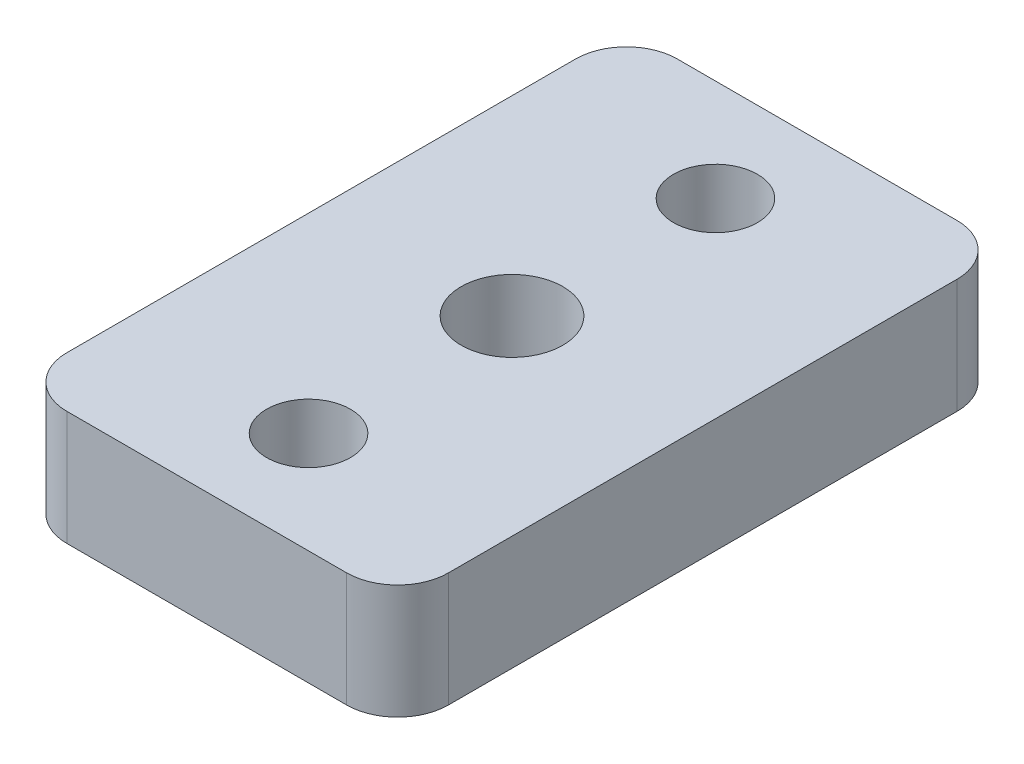
ISO-10303-21;
HEADER;
FILE_DESCRIPTION(('STEP AP214'),'2;1');
FILE_NAME('part.step','',(''),(''),'','','');
FILE_SCHEMA(('AUTOMOTIVE_DESIGN { 1 0 10303 214 1 1 1 1 }'));
ENDSEC;
DATA;
#1=APPLICATION_CONTEXT('core data for automotive mechanical design processes');
#2=APPLICATION_PROTOCOL_DEFINITION('international standard','automotive_design',2000,#1);
#3=PRODUCT_CONTEXT('',#1,'mechanical');
#4=PRODUCT('Part','Part','',(#3));
#5=PRODUCT_RELATED_PRODUCT_CATEGORY('part','',(#4));
#6=PRODUCT_DEFINITION_FORMATION('','',#4);
#7=PRODUCT_DEFINITION_CONTEXT('part definition',#1,'design');
#8=PRODUCT_DEFINITION('design','',#6,#7);
#9=PRODUCT_DEFINITION_SHAPE('','',#8);
#10=(LENGTH_UNIT() NAMED_UNIT(*) SI_UNIT(.MILLI.,.METRE.));
#11=(NAMED_UNIT(*) PLANE_ANGLE_UNIT() SI_UNIT($,.RADIAN.));
#12=(NAMED_UNIT(*) SI_UNIT($,.STERADIAN.) SOLID_ANGLE_UNIT());
#13=UNCERTAINTY_MEASURE_WITH_UNIT(LENGTH_MEASURE(1.E-05),#10,'distance_accuracy_value','');
#14=(GEOMETRIC_REPRESENTATION_CONTEXT(3) GLOBAL_UNCERTAINTY_ASSIGNED_CONTEXT((#13)) GLOBAL_UNIT_ASSIGNED_CONTEXT((#10,
#11,#12)) REPRESENTATION_CONTEXT('',''));
#15=CARTESIAN_POINT('',(0.,0.,0.));
#16=DIRECTION('',(0.,0.,1.));
#17=DIRECTION('',(1.,0.,0.));
#18=AXIS2_PLACEMENT_3D('',#15,#16,#17);
#19=CARTESIAN_POINT('',(5.5,0.,-10.));
#20=DIRECTION('',(0.,1.,0.));
#21=DIRECTION('',(0.,0.,1.));
#22=AXIS2_PLACEMENT_3D('',#19,#20,#21);
#23=CYLINDRICAL_SURFACE('',#22,2.);
#24=CARTESIAN_POINT('',(5.5,4.5,-10.));
#25=DIRECTION('',(0.,1.,0.));
#26=DIRECTION('',(0.,0.,1.));
#27=AXIS2_PLACEMENT_3D('',#24,#25,#26);
#28=CIRCLE('',#27,2.);
#29=CARTESIAN_POINT('',(7.5,4.5,-10.));
#30=VERTEX_POINT('',#29);
#31=CARTESIAN_POINT('',(5.5,4.5,-12.));
#32=VERTEX_POINT('',#31);
#33=EDGE_CURVE('E134',#30,#32,#28,.T.);
#34=ORIENTED_EDGE('',*,*,#33,.F.);
#35=DIRECTION('',(0.,1.,0.));
#36=VECTOR('',#35,1.);
#37=CARTESIAN_POINT('',(7.5,0.,-10.));
#38=LINE('',#37,#36);
#39=CARTESIAN_POINT('',(7.5,0.,-10.));
#40=VERTEX_POINT('',#39);
#41=EDGE_CURVE('E11',#40,#30,#38,.T.);
#42=ORIENTED_EDGE('',*,*,#41,.F.);
#43=CARTESIAN_POINT('',(5.5,0.,-10.));
#44=DIRECTION('',(0.,1.,0.));
#45=DIRECTION('',(0.,0.,1.));
#46=AXIS2_PLACEMENT_3D('',#43,#44,#45);
#47=CIRCLE('',#46,2.);
#48=CARTESIAN_POINT('',(5.5,0.,-12.));
#49=VERTEX_POINT('',#48);
#50=EDGE_CURVE('E155',#40,#49,#47,.T.);
#51=ORIENTED_EDGE('',*,*,#50,.T.);
#52=DIRECTION('',(0.,1.,0.));
#53=VECTOR('',#52,1.);
#54=CARTESIAN_POINT('',(5.5,0.,-12.));
#55=LINE('',#54,#53);
#56=EDGE_CURVE('E40',#49,#32,#55,.T.);
#57=ORIENTED_EDGE('',*,*,#56,.T.);
#58=EDGE_LOOP('',(#34,#42,#51,#57));
#59=FACE_BOUND('',#58,.T.);
#60=ADVANCED_FACE('F37',(#59),#23,.T.);
#61=CARTESIAN_POINT('',(7.5,0.,10.));
#62=DIRECTION('',(1.,0.,0.));
#63=DIRECTION('',(0.,0.,-1.));
#64=AXIS2_PLACEMENT_3D('',#61,#62,#63);
#65=PLANE('',#64);
#66=DIRECTION('',(0.,0.,-1.));
#67=VECTOR('',#66,1.);
#68=CARTESIAN_POINT('',(7.5,4.5,10.));
#69=LINE('',#68,#67);
#70=CARTESIAN_POINT('',(7.5,4.5,10.));
#71=VERTEX_POINT('',#70);
#72=EDGE_CURVE('E153',#71,#30,#69,.T.);
#73=ORIENTED_EDGE('',*,*,#72,.F.);
#74=DIRECTION('',(0.,1.,0.));
#75=VECTOR('',#74,1.);
#76=CARTESIAN_POINT('',(7.5,0.,10.));
#77=LINE('',#76,#75);
#78=CARTESIAN_POINT('',(7.5,0.,10.));
#79=VERTEX_POINT('',#78);
#80=EDGE_CURVE('E46',#79,#71,#77,.T.);
#81=ORIENTED_EDGE('',*,*,#80,.F.);
#82=DIRECTION('',(0.,0.,-1.));
#83=VECTOR('',#82,1.);
#84=CARTESIAN_POINT('',(7.5,0.,10.));
#85=LINE('',#84,#83);
#86=EDGE_CURVE('E124',#79,#40,#85,.T.);
#87=ORIENTED_EDGE('',*,*,#86,.T.);
#88=ORIENTED_EDGE('',*,*,#41,.T.);
#89=EDGE_LOOP('',(#73,#81,#87,#88));
#90=FACE_BOUND('',#89,.T.);
#91=ADVANCED_FACE('F167',(#90),#65,.T.);
#92=CARTESIAN_POINT('',(5.5,0.,10.));
#93=DIRECTION('',(0.,1.,0.));
#94=DIRECTION('',(0.,0.,1.));
#95=AXIS2_PLACEMENT_3D('',#92,#93,#94);
#96=CYLINDRICAL_SURFACE('',#95,2.);
#97=CARTESIAN_POINT('',(5.5,4.5,10.));
#98=DIRECTION('',(0.,1.,0.));
#99=DIRECTION('',(0.,0.,1.));
#100=AXIS2_PLACEMENT_3D('',#97,#98,#99);
#101=CIRCLE('',#100,2.);
#102=CARTESIAN_POINT('',(5.5,4.5,12.));
#103=VERTEX_POINT('',#102);
#104=EDGE_CURVE('E111',#103,#71,#101,.T.);
#105=ORIENTED_EDGE('',*,*,#104,.F.);
#106=DIRECTION('',(0.,1.,0.));
#107=VECTOR('',#106,1.);
#108=CARTESIAN_POINT('',(5.5,0.,12.));
#109=LINE('',#108,#107);
#110=CARTESIAN_POINT('',(5.5,0.,12.));
#111=VERTEX_POINT('',#110);
#112=EDGE_CURVE('E106',#111,#103,#109,.T.);
#113=ORIENTED_EDGE('',*,*,#112,.F.);
#114=CARTESIAN_POINT('',(5.5,0.,10.));
#115=DIRECTION('',(0.,1.,0.));
#116=DIRECTION('',(0.,0.,1.));
#117=AXIS2_PLACEMENT_3D('',#114,#115,#116);
#118=CIRCLE('',#117,2.);
#119=EDGE_CURVE('E109',#111,#79,#118,.T.);
#120=ORIENTED_EDGE('',*,*,#119,.T.);
#121=ORIENTED_EDGE('',*,*,#80,.T.);
#122=EDGE_LOOP('',(#105,#113,#120,#121));
#123=FACE_BOUND('',#122,.T.);
#124=ADVANCED_FACE('F108',(#123),#96,.T.);
#125=CARTESIAN_POINT('',(-5.5,0.,12.));
#126=DIRECTION('',(0.,0.,1.));
#127=DIRECTION('',(1.,0.,0.));
#128=AXIS2_PLACEMENT_3D('',#125,#126,#127);
#129=PLANE('',#128);
#130=DIRECTION('',(1.,0.,0.));
#131=VECTOR('',#130,1.);
#132=CARTESIAN_POINT('',(-5.5,4.5,12.));
#133=LINE('',#132,#131);
#134=CARTESIAN_POINT('',(-5.5,4.5,12.));
#135=VERTEX_POINT('',#134);
#136=EDGE_CURVE('E150',#135,#103,#133,.T.);
#137=ORIENTED_EDGE('',*,*,#136,.F.);
#138=DIRECTION('',(0.,1.,0.));
#139=VECTOR('',#138,1.);
#140=CARTESIAN_POINT('',(-5.5,0.,12.));
#141=LINE('',#140,#139);
#142=CARTESIAN_POINT('',(-5.5,0.,12.));
#143=VERTEX_POINT('',#142);
#144=EDGE_CURVE('E116',#143,#135,#141,.T.);
#145=ORIENTED_EDGE('',*,*,#144,.F.);
#146=DIRECTION('',(1.,0.,0.));
#147=VECTOR('',#146,1.);
#148=CARTESIAN_POINT('',(-5.5,0.,12.));
#149=LINE('',#148,#147);
#150=EDGE_CURVE('E122',#143,#111,#149,.T.);
#151=ORIENTED_EDGE('',*,*,#150,.T.);
#152=ORIENTED_EDGE('',*,*,#112,.T.);
#153=EDGE_LOOP('',(#137,#145,#151,#152));
#154=FACE_BOUND('',#153,.T.);
#155=ADVANCED_FACE('F126',(#154),#129,.T.);
#156=CARTESIAN_POINT('',(-5.5,0.,10.));
#157=DIRECTION('',(0.,1.,0.));
#158=DIRECTION('',(0.,0.,1.));
#159=AXIS2_PLACEMENT_3D('',#156,#157,#158);
#160=CYLINDRICAL_SURFACE('',#159,2.);
#161=CARTESIAN_POINT('',(-5.5,4.5,10.));
#162=DIRECTION('',(0.,1.,0.));
#163=DIRECTION('',(0.,0.,1.));
#164=AXIS2_PLACEMENT_3D('',#161,#162,#163);
#165=CIRCLE('',#164,2.);
#166=CARTESIAN_POINT('',(-7.5,4.5,10.));
#167=VERTEX_POINT('',#166);
#168=EDGE_CURVE('E147',#167,#135,#165,.T.);
#169=ORIENTED_EDGE('',*,*,#168,.F.);
#170=DIRECTION('',(0.,1.,0.));
#171=VECTOR('',#170,1.);
#172=CARTESIAN_POINT('',(-7.5,0.,10.));
#173=LINE('',#172,#171);
#174=CARTESIAN_POINT('',(-7.5,0.,10.));
#175=VERTEX_POINT('',#174);
#176=EDGE_CURVE('E159',#175,#167,#173,.T.);
#177=ORIENTED_EDGE('',*,*,#176,.F.);
#178=CARTESIAN_POINT('',(-5.5,0.,10.));
#179=DIRECTION('',(0.,1.,0.));
#180=DIRECTION('',(0.,0.,1.));
#181=AXIS2_PLACEMENT_3D('',#178,#179,#180);
#182=CIRCLE('',#181,2.);
#183=EDGE_CURVE('E127',#175,#143,#182,.T.);
#184=ORIENTED_EDGE('',*,*,#183,.T.);
#185=ORIENTED_EDGE('',*,*,#144,.T.);
#186=EDGE_LOOP('',(#169,#177,#184,#185));
#187=FACE_BOUND('',#186,.T.);
#188=ADVANCED_FACE('F180',(#187),#160,.T.);
#189=CARTESIAN_POINT('',(-7.5,0.,-10.));
#190=DIRECTION('',(-1.,0.,0.));
#191=DIRECTION('',(0.,0.,1.));
#192=AXIS2_PLACEMENT_3D('',#189,#190,#191);
#193=PLANE('',#192);
#194=DIRECTION('',(0.,0.,1.));
#195=VECTOR('',#194,1.);
#196=CARTESIAN_POINT('',(-7.5,4.5,-10.));
#197=LINE('',#196,#195);
#198=CARTESIAN_POINT('',(-7.5,4.5,-10.));
#199=VERTEX_POINT('',#198);
#200=EDGE_CURVE('E144',#199,#167,#197,.T.);
#201=ORIENTED_EDGE('',*,*,#200,.F.);
#202=DIRECTION('',(0.,1.,0.));
#203=VECTOR('',#202,1.);
#204=CARTESIAN_POINT('',(-7.5,0.,-10.));
#205=LINE('',#204,#203);
#206=CARTESIAN_POINT('',(-7.5,0.,-10.));
#207=VERTEX_POINT('',#206);
#208=EDGE_CURVE('E161',#207,#199,#205,.T.);
#209=ORIENTED_EDGE('',*,*,#208,.F.);
#210=DIRECTION('',(0.,0.,1.));
#211=VECTOR('',#210,1.);
#212=CARTESIAN_POINT('',(-7.5,0.,-10.));
#213=LINE('',#212,#211);
#214=EDGE_CURVE('E129',#207,#175,#213,.T.);
#215=ORIENTED_EDGE('',*,*,#214,.T.);
#216=ORIENTED_EDGE('',*,*,#176,.T.);
#217=EDGE_LOOP('',(#201,#209,#215,#216));
#218=FACE_BOUND('',#217,.T.);
#219=ADVANCED_FACE('F183',(#218),#193,.T.);
#220=CARTESIAN_POINT('',(-5.5,0.,-10.));
#221=DIRECTION('',(0.,1.,0.));
#222=DIRECTION('',(0.,0.,1.));
#223=AXIS2_PLACEMENT_3D('',#220,#221,#222);
#224=CYLINDRICAL_SURFACE('',#223,2.);
#225=CARTESIAN_POINT('',(-5.5,4.5,-10.));
#226=DIRECTION('',(0.,1.,0.));
#227=DIRECTION('',(0.,0.,1.));
#228=AXIS2_PLACEMENT_3D('',#225,#226,#227);
#229=CIRCLE('',#228,2.);
#230=CARTESIAN_POINT('',(-5.5,4.5,-12.));
#231=VERTEX_POINT('',#230);
#232=EDGE_CURVE('E141',#231,#199,#229,.T.);
#233=ORIENTED_EDGE('',*,*,#232,.F.);
#234=DIRECTION('',(0.,1.,0.));
#235=VECTOR('',#234,1.);
#236=CARTESIAN_POINT('',(-5.5,0.,-12.));
#237=LINE('',#236,#235);
#238=CARTESIAN_POINT('',(-5.5,0.,-12.));
#239=VERTEX_POINT('',#238);
#240=EDGE_CURVE('E162',#239,#231,#237,.T.);
#241=ORIENTED_EDGE('',*,*,#240,.F.);
#242=CARTESIAN_POINT('',(-5.5,0.,-10.));
#243=DIRECTION('',(0.,1.,0.));
#244=DIRECTION('',(0.,0.,1.));
#245=AXIS2_PLACEMENT_3D('',#242,#243,#244);
#246=CIRCLE('',#245,2.);
#247=EDGE_CURVE('E239',#239,#207,#246,.T.);
#248=ORIENTED_EDGE('',*,*,#247,.T.);
#249=ORIENTED_EDGE('',*,*,#208,.T.);
#250=EDGE_LOOP('',(#233,#241,#248,#249));
#251=FACE_BOUND('',#250,.T.);
#252=ADVANCED_FACE('F187',(#251),#224,.T.);
#253=CARTESIAN_POINT('',(5.5,0.,-12.));
#254=DIRECTION('',(0.,0.,-1.));
#255=DIRECTION('',(-1.,0.,0.));
#256=AXIS2_PLACEMENT_3D('',#253,#254,#255);
#257=PLANE('',#256);
#258=DIRECTION('',(-1.,0.,0.));
#259=VECTOR('',#258,1.);
#260=CARTESIAN_POINT('',(5.5,4.5,-12.));
#261=LINE('',#260,#259);
#262=EDGE_CURVE('E137',#32,#231,#261,.T.);
#263=ORIENTED_EDGE('',*,*,#262,.F.);
#264=ORIENTED_EDGE('',*,*,#56,.F.);
#265=DIRECTION('',(-1.,0.,0.));
#266=VECTOR('',#265,1.);
#267=CARTESIAN_POINT('',(5.5,0.,-12.));
#268=LINE('',#267,#266);
#269=EDGE_CURVE('E237',#49,#239,#268,.T.);
#270=ORIENTED_EDGE('',*,*,#269,.T.);
#271=ORIENTED_EDGE('',*,*,#240,.T.);
#272=EDGE_LOOP('',(#263,#264,#270,#271));
#273=FACE_BOUND('',#272,.T.);
#274=ADVANCED_FACE('F164',(#273),#257,.T.);
#275=CARTESIAN_POINT('',(5.5,0.,-10.));
#276=DIRECTION('',(0.,1.,0.));
#277=DIRECTION('',(0.,0.,1.));
#278=AXIS2_PLACEMENT_3D('',#275,#276,#277);
#279=PLANE('',#278);
#280=CARTESIAN_POINT('',(0.,0.,-8.));
#281=DIRECTION('',(0.,1.,0.));
#282=DIRECTION('',(0.,0.,-1.));
#283=AXIS2_PLACEMENT_3D('',#280,#281,#282);
#284=CIRCLE('',#283,1.65);
#285=CARTESIAN_POINT('',(0.,0.,-9.65));
#286=VERTEX_POINT('',#285);
#287=EDGE_CURVE('E218',#286,#286,#284,.T.);
#288=ORIENTED_EDGE('',*,*,#287,.T.);
#289=EDGE_LOOP('',(#288));
#290=FACE_BOUND('',#289,.T.);
#291=CARTESIAN_POINT('',(0.,0.,8.));
#292=DIRECTION('',(0.,1.,0.));
#293=DIRECTION('',(0.,0.,-1.));
#294=AXIS2_PLACEMENT_3D('',#291,#292,#293);
#295=CIRCLE('',#294,1.65);
#296=CARTESIAN_POINT('',(0.,0.,6.35));
#297=VERTEX_POINT('',#296);
#298=EDGE_CURVE('E226',#297,#297,#295,.T.);
#299=ORIENTED_EDGE('',*,*,#298,.T.);
#300=EDGE_LOOP('',(#299));
#301=FACE_BOUND('',#300,.T.);
#302=CARTESIAN_POINT('',(0.,0.,0.));
#303=DIRECTION('',(0.,1.,0.));
#304=DIRECTION('',(0.,0.,-1.));
#305=AXIS2_PLACEMENT_3D('',#302,#303,#304);
#306=CIRCLE('',#305,2.);
#307=CARTESIAN_POINT('',(0.,0.,-2.));
#308=VERTEX_POINT('',#307);
#309=EDGE_CURVE('E138',#308,#308,#306,.T.);
#310=ORIENTED_EDGE('',*,*,#309,.T.);
#311=EDGE_LOOP('',(#310));
#312=FACE_BOUND('',#311,.T.);
#313=ORIENTED_EDGE('',*,*,#50,.F.);
#314=ORIENTED_EDGE('',*,*,#86,.F.);
#315=ORIENTED_EDGE('',*,*,#119,.F.);
#316=ORIENTED_EDGE('',*,*,#150,.F.);
#317=ORIENTED_EDGE('',*,*,#183,.F.);
#318=ORIENTED_EDGE('',*,*,#214,.F.);
#319=ORIENTED_EDGE('',*,*,#247,.F.);
#320=ORIENTED_EDGE('',*,*,#269,.F.);
#321=EDGE_LOOP('',(#313,#314,#315,#316,#317,#318,#319,#320));
#322=FACE_BOUND('',#321,.T.);
#323=ADVANCED_FACE('F120',(#290,#301,#312,#322),#279,.F.);
#324=CARTESIAN_POINT('',(5.5,4.5,-10.));
#325=DIRECTION('',(0.,1.,0.));
#326=DIRECTION('',(0.,0.,1.));
#327=AXIS2_PLACEMENT_3D('',#324,#325,#326);
#328=PLANE('',#327);
#329=CARTESIAN_POINT('',(0.,4.5,-8.));
#330=DIRECTION('',(0.,1.,0.));
#331=DIRECTION('',(0.,0.,-1.));
#332=AXIS2_PLACEMENT_3D('',#329,#330,#331);
#333=CIRCLE('',#332,1.65);
#334=CARTESIAN_POINT('',(0.,4.5,-9.65));
#335=VERTEX_POINT('',#334);
#336=EDGE_CURVE('E221',#335,#335,#333,.T.);
#337=ORIENTED_EDGE('',*,*,#336,.F.);
#338=EDGE_LOOP('',(#337));
#339=FACE_BOUND('',#338,.T.);
#340=CARTESIAN_POINT('',(0.,4.5,8.));
#341=DIRECTION('',(0.,1.,0.));
#342=DIRECTION('',(0.,0.,-1.));
#343=AXIS2_PLACEMENT_3D('',#340,#341,#342);
#344=CIRCLE('',#343,1.65);
#345=CARTESIAN_POINT('',(0.,4.5,6.35));
#346=VERTEX_POINT('',#345);
#347=EDGE_CURVE('E223',#346,#346,#344,.T.);
#348=ORIENTED_EDGE('',*,*,#347,.F.);
#349=EDGE_LOOP('',(#348));
#350=FACE_BOUND('',#349,.T.);
#351=CARTESIAN_POINT('',(0.,4.5,0.));
#352=DIRECTION('',(0.,1.,0.));
#353=DIRECTION('',(0.,0.,-1.));
#354=AXIS2_PLACEMENT_3D('',#351,#352,#353);
#355=CIRCLE('',#354,2.);
#356=CARTESIAN_POINT('',(0.,4.5,-2.));
#357=VERTEX_POINT('',#356);
#358=EDGE_CURVE('E229',#357,#357,#355,.T.);
#359=ORIENTED_EDGE('',*,*,#358,.F.);
#360=EDGE_LOOP('',(#359));
#361=FACE_BOUND('',#360,.T.);
#362=ORIENTED_EDGE('',*,*,#33,.T.);
#363=ORIENTED_EDGE('',*,*,#262,.T.);
#364=ORIENTED_EDGE('',*,*,#232,.T.);
#365=ORIENTED_EDGE('',*,*,#200,.T.);
#366=ORIENTED_EDGE('',*,*,#168,.T.);
#367=ORIENTED_EDGE('',*,*,#136,.T.);
#368=ORIENTED_EDGE('',*,*,#104,.T.);
#369=ORIENTED_EDGE('',*,*,#72,.T.);
#370=EDGE_LOOP('',(#362,#363,#364,#365,#366,#367,#368,#369));
#371=FACE_BOUND('',#370,.T.);
#372=ADVANCED_FACE('F166',(#339,#350,#361,#371),#328,.T.);
#373=CARTESIAN_POINT('',(0.,0.,0.));
#374=DIRECTION('',(0.,1.,0.));
#375=DIRECTION('',(0.,0.,1.));
#376=AXIS2_PLACEMENT_3D('',#373,#374,#375);
#377=CYLINDRICAL_SURFACE('',#376,2.);
#378=ORIENTED_EDGE('',*,*,#309,.F.);
#379=EDGE_LOOP('',(#378));
#380=FACE_BOUND('',#379,.T.);
#381=ORIENTED_EDGE('',*,*,#358,.T.);
#382=EDGE_LOOP('',(#381));
#383=FACE_BOUND('',#382,.T.);
#384=ADVANCED_FACE('F199',(#380,#383),#377,.F.);
#385=CARTESIAN_POINT('',(0.,0.,8.));
#386=DIRECTION('',(0.,1.,0.));
#387=DIRECTION('',(0.,0.,1.));
#388=AXIS2_PLACEMENT_3D('',#385,#386,#387);
#389=CYLINDRICAL_SURFACE('',#388,1.65);
#390=ORIENTED_EDGE('',*,*,#298,.F.);
#391=EDGE_LOOP('',(#390));
#392=FACE_BOUND('',#391,.T.);
#393=ORIENTED_EDGE('',*,*,#347,.T.);
#394=EDGE_LOOP('',(#393));
#395=FACE_BOUND('',#394,.T.);
#396=ADVANCED_FACE('F206',(#392,#395),#389,.F.);
#397=CARTESIAN_POINT('',(0.,0.,-8.));
#398=DIRECTION('',(0.,1.,0.));
#399=DIRECTION('',(0.,0.,1.));
#400=AXIS2_PLACEMENT_3D('',#397,#398,#399);
#401=CYLINDRICAL_SURFACE('',#400,1.65);
#402=ORIENTED_EDGE('',*,*,#287,.F.);
#403=EDGE_LOOP('',(#402));
#404=FACE_BOUND('',#403,.T.);
#405=ORIENTED_EDGE('',*,*,#336,.T.);
#406=EDGE_LOOP('',(#405));
#407=FACE_BOUND('',#406,.T.);
#408=ADVANCED_FACE('F210',(#404,#407),#401,.F.);
#409=CLOSED_SHELL('',(#60,#91,#124,#155,#188,#219,#252,#274,#323,#372,#384,#396,#408));
#410=MANIFOLD_SOLID_BREP('B2',#409);
#411=ADVANCED_BREP_SHAPE_REPRESENTATION('',(#18,#410),#14);
#412=SHAPE_DEFINITION_REPRESENTATION(#9,#411);
ENDSEC;
END-ISO-10303-21;
